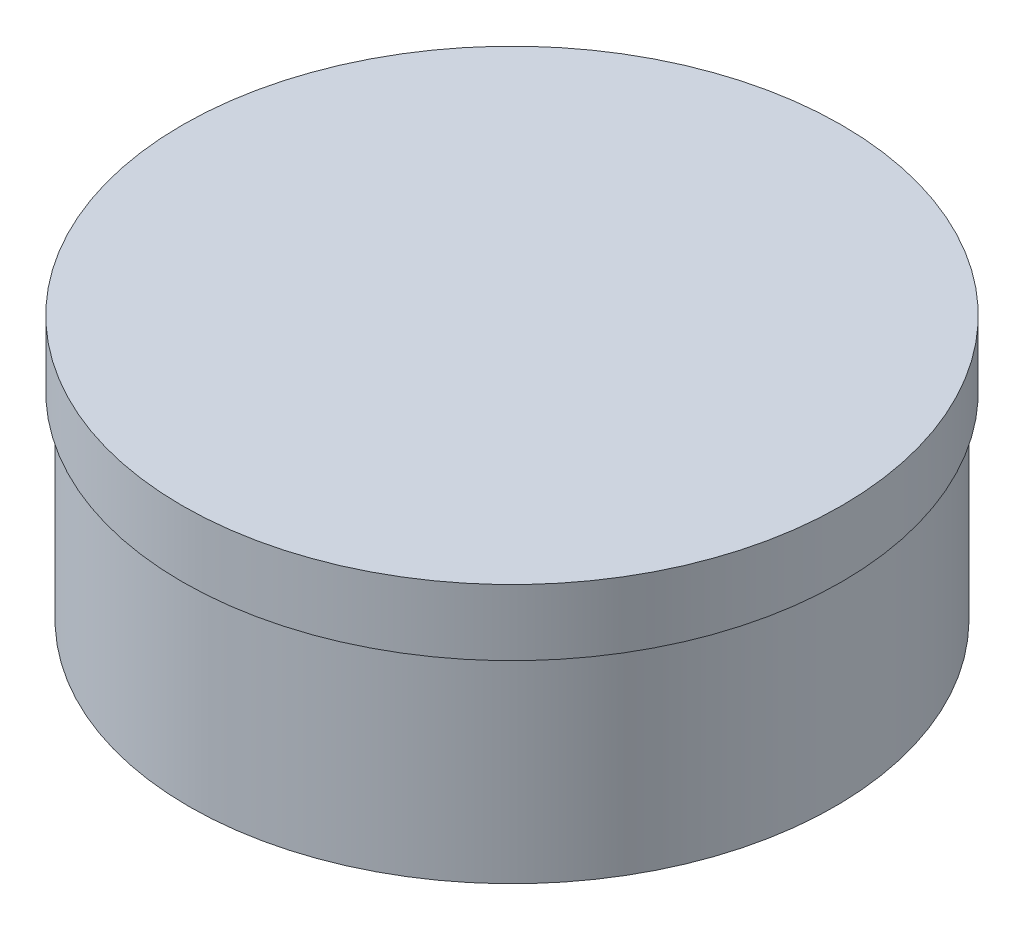
ISO-10303-21;
HEADER;
FILE_DESCRIPTION(('STEP AP214'),'2;1');
FILE_NAME('part.step','',(''),(''),'','','');
FILE_SCHEMA(('AUTOMOTIVE_DESIGN { 1 0 10303 214 1 1 1 1 }'));
ENDSEC;
DATA;
#1=APPLICATION_CONTEXT('core data for automotive mechanical design processes');
#2=APPLICATION_PROTOCOL_DEFINITION('international standard','automotive_design',2000,#1);
#3=PRODUCT_CONTEXT('',#1,'mechanical');
#4=PRODUCT('Part','Part','',(#3));
#5=PRODUCT_RELATED_PRODUCT_CATEGORY('part','',(#4));
#6=PRODUCT_DEFINITION_FORMATION('','',#4);
#7=PRODUCT_DEFINITION_CONTEXT('part definition',#1,'design');
#8=PRODUCT_DEFINITION('design','',#6,#7);
#9=PRODUCT_DEFINITION_SHAPE('','',#8);
#10=(LENGTH_UNIT() NAMED_UNIT(*) SI_UNIT(.MILLI.,.METRE.));
#11=(NAMED_UNIT(*) PLANE_ANGLE_UNIT() SI_UNIT($,.RADIAN.));
#12=(NAMED_UNIT(*) SI_UNIT($,.STERADIAN.) SOLID_ANGLE_UNIT());
#13=UNCERTAINTY_MEASURE_WITH_UNIT(LENGTH_MEASURE(1.E-05),#10,'distance_accuracy_value','');
#14=(GEOMETRIC_REPRESENTATION_CONTEXT(3) GLOBAL_UNCERTAINTY_ASSIGNED_CONTEXT((#13)) GLOBAL_UNIT_ASSIGNED_CONTEXT((#10,
#11,#12)) REPRESENTATION_CONTEXT('',''));
#15=CARTESIAN_POINT('',(0.,0.,0.));
#16=DIRECTION('',(0.,0.,1.));
#17=DIRECTION('',(1.,0.,0.));
#18=AXIS2_PLACEMENT_3D('',#15,#16,#17);
#19=CARTESIAN_POINT('',(0.,0.,0.));
#20=DIRECTION('',(0.,1.,0.));
#21=DIRECTION('',(0.,0.,1.));
#22=AXIS2_PLACEMENT_3D('',#19,#20,#21);
#23=PLANE('',#22);
#24=CARTESIAN_POINT('',(0.,0.,0.));
#25=DIRECTION('',(0.,1.,0.));
#26=DIRECTION('',(0.,0.,1.));
#27=AXIS2_PLACEMENT_3D('',#24,#25,#26);
#28=CIRCLE('',#27,4.3);
#29=CARTESIAN_POINT('',(0.,0.,4.3));
#30=VERTEX_POINT('',#29);
#31=EDGE_CURVE('E40',#30,#30,#28,.T.);
#32=ORIENTED_EDGE('',*,*,#31,.T.);
#33=EDGE_LOOP('',(#32));
#34=FACE_BOUND('',#33,.T.);
#35=CARTESIAN_POINT('',(0.,0.,0.));
#36=DIRECTION('',(0.,1.,0.));
#37=DIRECTION('',(0.,0.,1.));
#38=AXIS2_PLACEMENT_3D('',#35,#36,#37);
#39=CIRCLE('',#38,4.9);
#40=CARTESIAN_POINT('',(0.,0.,4.9));
#41=VERTEX_POINT('',#40);
#42=EDGE_CURVE('E48',#41,#41,#39,.T.);
#43=ORIENTED_EDGE('',*,*,#42,.F.);
#44=EDGE_LOOP('',(#43));
#45=FACE_BOUND('',#44,.T.);
#46=ADVANCED_FACE('F33',(#34,#45),#23,.F.);
#47=CARTESIAN_POINT('',(0.,3.,0.));
#48=DIRECTION('',(0.,-1.,0.));
#49=DIRECTION('',(0.,0.,-1.));
#50=AXIS2_PLACEMENT_3D('',#47,#48,#49);
#51=CYLINDRICAL_SURFACE('',#50,4.9);
#52=CARTESIAN_POINT('',(0.,3.,0.));
#53=DIRECTION('',(0.,1.,0.));
#54=DIRECTION('',(0.,0.,1.));
#55=AXIS2_PLACEMENT_3D('',#52,#53,#54);
#56=CIRCLE('',#55,4.9);
#57=CARTESIAN_POINT('',(0.,3.,4.9));
#58=VERTEX_POINT('',#57);
#59=EDGE_CURVE('E44',#58,#58,#56,.T.);
#60=ORIENTED_EDGE('',*,*,#59,.F.);
#61=EDGE_LOOP('',(#60));
#62=FACE_BOUND('',#61,.T.);
#63=ORIENTED_EDGE('',*,*,#42,.T.);
#64=EDGE_LOOP('',(#63));
#65=FACE_BOUND('',#64,.T.);
#66=ADVANCED_FACE('F86',(#62,#65),#51,.T.);
#67=CARTESIAN_POINT('',(0.,3.,0.));
#68=DIRECTION('',(0.,-1.,0.));
#69=DIRECTION('',(0.,0.,-1.));
#70=AXIS2_PLACEMENT_3D('',#67,#68,#69);
#71=CYLINDRICAL_SURFACE('',#70,3.8);
#72=CARTESIAN_POINT('',(0.,0.500000000000003,0.));
#73=DIRECTION('',(0.,1.,0.));
#74=DIRECTION('',(0.,0.,1.));
#75=AXIS2_PLACEMENT_3D('',#72,#73,#74);
#76=CIRCLE('',#75,3.8);
#77=CARTESIAN_POINT('',(0.,0.500000000000003,3.8));
#78=VERTEX_POINT('',#77);
#79=EDGE_CURVE('E10',#78,#78,#76,.F.);
#80=ORIENTED_EDGE('',*,*,#79,.T.);
#81=EDGE_LOOP('',(#80));
#82=FACE_BOUND('',#81,.T.);
#83=CARTESIAN_POINT('',(0.,3.,0.));
#84=DIRECTION('',(0.,1.,0.));
#85=DIRECTION('',(0.,0.,1.));
#86=AXIS2_PLACEMENT_3D('',#83,#84,#85);
#87=CIRCLE('',#86,3.8);
#88=CARTESIAN_POINT('',(0.,3.,3.8));
#89=VERTEX_POINT('',#88);
#90=EDGE_CURVE('E52',#89,#89,#87,.T.);
#91=ORIENTED_EDGE('',*,*,#90,.T.);
#92=EDGE_LOOP('',(#91));
#93=FACE_BOUND('',#92,.T.);
#94=ADVANCED_FACE('F83',(#82,#93),#71,.F.);
#95=CARTESIAN_POINT('',(0.,3.,0.));
#96=DIRECTION('',(0.,1.,0.));
#97=DIRECTION('',(0.,0.,1.));
#98=AXIS2_PLACEMENT_3D('',#95,#96,#97);
#99=PLANE('',#98);
#100=ORIENTED_EDGE('',*,*,#90,.F.);
#101=EDGE_LOOP('',(#100));
#102=FACE_BOUND('',#101,.T.);
#103=ADVANCED_FACE('F68',(#102),#99,.F.);
#104=CARTESIAN_POINT('',(0.,4.,0.));
#105=DIRECTION('',(0.,-1.,0.));
#106=DIRECTION('',(0.,0.,-1.));
#107=AXIS2_PLACEMENT_3D('',#104,#105,#106);
#108=CYLINDRICAL_SURFACE('',#107,5.);
#109=CARTESIAN_POINT('',(0.,4.,0.));
#110=DIRECTION('',(0.,1.,0.));
#111=DIRECTION('',(0.,0.,1.));
#112=AXIS2_PLACEMENT_3D('',#109,#110,#111);
#113=CIRCLE('',#112,5.);
#114=CARTESIAN_POINT('',(0.,4.,5.));
#115=VERTEX_POINT('',#114);
#116=EDGE_CURVE('E56',#115,#115,#113,.T.);
#117=ORIENTED_EDGE('',*,*,#116,.F.);
#118=EDGE_LOOP('',(#117));
#119=FACE_BOUND('',#118,.T.);
#120=CARTESIAN_POINT('',(0.,3.,0.));
#121=DIRECTION('',(0.,1.,0.));
#122=DIRECTION('',(0.,0.,1.));
#123=AXIS2_PLACEMENT_3D('',#120,#121,#122);
#124=CIRCLE('',#123,5.);
#125=CARTESIAN_POINT('',(0.,3.,5.));
#126=VERTEX_POINT('',#125);
#127=EDGE_CURVE('E57',#126,#126,#124,.T.);
#128=ORIENTED_EDGE('',*,*,#127,.T.);
#129=EDGE_LOOP('',(#128));
#130=FACE_BOUND('',#129,.T.);
#131=ADVANCED_FACE('F65',(#119,#130),#108,.T.);
#132=CARTESIAN_POINT('',(0.,4.,0.));
#133=DIRECTION('',(0.,1.,0.));
#134=DIRECTION('',(0.,0.,1.));
#135=AXIS2_PLACEMENT_3D('',#132,#133,#134);
#136=PLANE('',#135);
#137=ORIENTED_EDGE('',*,*,#116,.T.);
#138=EDGE_LOOP('',(#137));
#139=FACE_BOUND('',#138,.T.);
#140=ADVANCED_FACE('F63',(#139),#136,.T.);
#141=ORIENTED_EDGE('',*,*,#59,.T.);
#142=EDGE_LOOP('',(#141));
#143=FACE_BOUND('',#142,.T.);
#144=ORIENTED_EDGE('',*,*,#127,.F.);
#145=EDGE_LOOP('',(#144));
#146=FACE_BOUND('',#145,.T.);
#147=ADVANCED_FACE('F72',(#143,#146),#99,.F.);
#148=CARTESIAN_POINT('',(0.,0.,0.));
#149=DIRECTION('',(0.,-1.,0.));
#150=DIRECTION('',(0.,0.,-1.));
#151=AXIS2_PLACEMENT_3D('',#148,#149,#150);
#152=CONICAL_SURFACE('',#151,4.3,0.785398163397446);
#153=ORIENTED_EDGE('',*,*,#79,.F.);
#154=EDGE_LOOP('',(#153));
#155=FACE_BOUND('',#154,.T.);
#156=ORIENTED_EDGE('',*,*,#31,.F.);
#157=EDGE_LOOP('',(#156));
#158=FACE_BOUND('',#157,.T.);
#159=ADVANCED_FACE('F35',(#155,#158),#152,.F.);
#160=CLOSED_SHELL('',(#46,#66,#94,#103,#131,#140,#147,#159));
#161=MANIFOLD_SOLID_BREP('B2',#160);
#162=ADVANCED_BREP_SHAPE_REPRESENTATION('',(#18,#161),#14);
#163=SHAPE_DEFINITION_REPRESENTATION(#9,#162);
ENDSEC;
END-ISO-10303-21;
